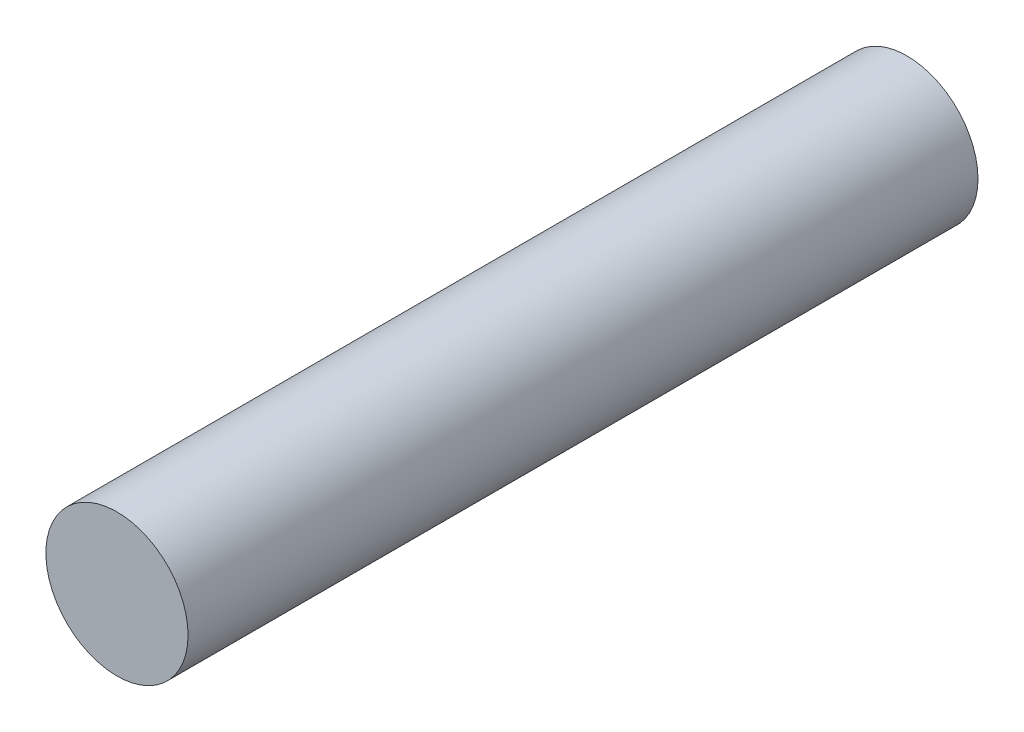
ISO-10303-21;
HEADER;
FILE_DESCRIPTION(('STEP AP214'),'2;1');
FILE_NAME('part.step','',(''),(''),'','','');
FILE_SCHEMA(('AUTOMOTIVE_DESIGN { 1 0 10303 214 1 1 1 1 }'));
ENDSEC;
DATA;
#1=APPLICATION_CONTEXT('core data for automotive mechanical design processes');
#2=APPLICATION_PROTOCOL_DEFINITION('international standard','automotive_design',2000,#1);
#3=PRODUCT_CONTEXT('',#1,'mechanical');
#4=PRODUCT('Part','Part','',(#3));
#5=PRODUCT_RELATED_PRODUCT_CATEGORY('part','',(#4));
#6=PRODUCT_DEFINITION_FORMATION('','',#4);
#7=PRODUCT_DEFINITION_CONTEXT('part definition',#1,'design');
#8=PRODUCT_DEFINITION('design','',#6,#7);
#9=PRODUCT_DEFINITION_SHAPE('','',#8);
#10=(LENGTH_UNIT() NAMED_UNIT(*) SI_UNIT(.MILLI.,.METRE.));
#11=(NAMED_UNIT(*) PLANE_ANGLE_UNIT() SI_UNIT($,.RADIAN.));
#12=(NAMED_UNIT(*) SI_UNIT($,.STERADIAN.) SOLID_ANGLE_UNIT());
#13=UNCERTAINTY_MEASURE_WITH_UNIT(LENGTH_MEASURE(1.E-05),#10,'distance_accuracy_value','');
#14=(GEOMETRIC_REPRESENTATION_CONTEXT(3) GLOBAL_UNCERTAINTY_ASSIGNED_CONTEXT((#13)) GLOBAL_UNIT_ASSIGNED_CONTEXT((#10,
#11,#12)) REPRESENTATION_CONTEXT('',''));
#15=CARTESIAN_POINT('',(0.,0.,0.));
#16=DIRECTION('',(0.,0.,1.));
#17=DIRECTION('',(1.,0.,0.));
#18=AXIS2_PLACEMENT_3D('',#15,#16,#17);
#19=CARTESIAN_POINT('',(-2.13919775020528,7.05840416386722,20.));
#20=DIRECTION('',(0.,0.,-1.));
#21=DIRECTION('',(-1.,0.,0.));
#22=AXIS2_PLACEMENT_3D('',#19,#20,#21);
#23=CYLINDRICAL_SURFACE('',#22,1.8);
#24=CARTESIAN_POINT('',(-2.13919775020528,7.05840416386722,20.));
#25=DIRECTION('',(0.,0.,1.));
#26=DIRECTION('',(1.,0.,0.));
#27=AXIS2_PLACEMENT_3D('',#24,#25,#26);
#28=CIRCLE('',#27,1.8);
#29=CARTESIAN_POINT('',(-0.339197750205282,7.05840416386722,20.));
#30=VERTEX_POINT('',#29);
#31=EDGE_CURVE('E10',#30,#30,#28,.T.);
#32=ORIENTED_EDGE('',*,*,#31,.F.);
#33=EDGE_LOOP('',(#32));
#34=FACE_BOUND('',#33,.T.);
#35=CARTESIAN_POINT('',(-2.13919775020528,7.05840416386722,0.));
#36=DIRECTION('',(0.,0.,1.));
#37=DIRECTION('',(1.,0.,0.));
#38=AXIS2_PLACEMENT_3D('',#35,#36,#37);
#39=CIRCLE('',#38,1.8);
#40=CARTESIAN_POINT('',(-0.339197750205282,7.05840416386722,0.));
#41=VERTEX_POINT('',#40);
#42=EDGE_CURVE('E40',#41,#41,#39,.T.);
#43=ORIENTED_EDGE('',*,*,#42,.T.);
#44=EDGE_LOOP('',(#43));
#45=FACE_BOUND('',#44,.T.);
#46=ADVANCED_FACE('F37',(#34,#45),#23,.T.);
#47=CARTESIAN_POINT('',(-2.13919775020528,7.05840416386722,20.));
#48=DIRECTION('',(0.,0.,1.));
#49=DIRECTION('',(1.,0.,0.));
#50=AXIS2_PLACEMENT_3D('',#47,#48,#49);
#51=PLANE('',#50);
#52=ORIENTED_EDGE('',*,*,#31,.T.);
#53=EDGE_LOOP('',(#52));
#54=FACE_BOUND('',#53,.T.);
#55=ADVANCED_FACE('F54',(#54),#51,.T.);
#56=CARTESIAN_POINT('',(-2.13919775020528,7.05840416386722,0.));
#57=DIRECTION('',(0.,0.,1.));
#58=DIRECTION('',(1.,0.,0.));
#59=AXIS2_PLACEMENT_3D('',#56,#57,#58);
#60=PLANE('',#59);
#61=ORIENTED_EDGE('',*,*,#42,.F.);
#62=EDGE_LOOP('',(#61));
#63=FACE_BOUND('',#62,.T.);
#64=ADVANCED_FACE('F52',(#63),#60,.F.);
#65=CLOSED_SHELL('',(#46,#55,#64));
#66=MANIFOLD_SOLID_BREP('B2',#65);
#67=ADVANCED_BREP_SHAPE_REPRESENTATION('',(#18,#66),#14);
#68=SHAPE_DEFINITION_REPRESENTATION(#9,#67);
ENDSEC;
END-ISO-10303-21;
